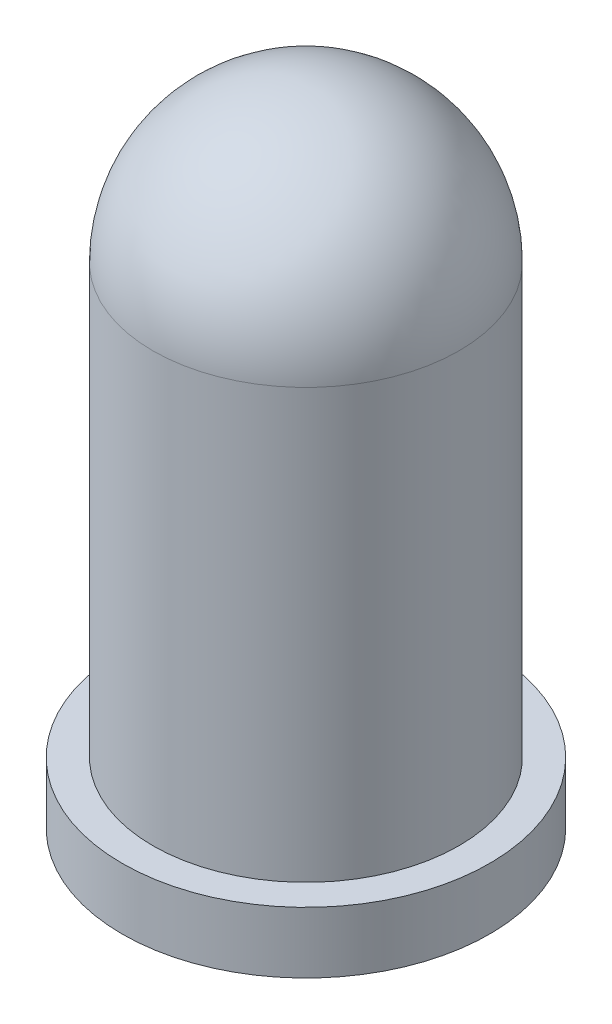
ISO-10303-21;
HEADER;
FILE_DESCRIPTION(('STEP AP214'),'2;1');
FILE_NAME('part.step','',(''),(''),'','','');
FILE_SCHEMA(('AUTOMOTIVE_DESIGN { 1 0 10303 214 1 1 1 1 }'));
ENDSEC;
DATA;
#1=APPLICATION_CONTEXT('core data for automotive mechanical design processes');
#2=APPLICATION_PROTOCOL_DEFINITION('international standard','automotive_design',2000,#1);
#3=PRODUCT_CONTEXT('',#1,'mechanical');
#4=PRODUCT('Part','Part','',(#3));
#5=PRODUCT_RELATED_PRODUCT_CATEGORY('part','',(#4));
#6=PRODUCT_DEFINITION_FORMATION('','',#4);
#7=PRODUCT_DEFINITION_CONTEXT('part definition',#1,'design');
#8=PRODUCT_DEFINITION('design','',#6,#7);
#9=PRODUCT_DEFINITION_SHAPE('','',#8);
#10=(LENGTH_UNIT() NAMED_UNIT(*) SI_UNIT(.MILLI.,.METRE.));
#11=(NAMED_UNIT(*) PLANE_ANGLE_UNIT() SI_UNIT($,.RADIAN.));
#12=(NAMED_UNIT(*) SI_UNIT($,.STERADIAN.) SOLID_ANGLE_UNIT());
#13=UNCERTAINTY_MEASURE_WITH_UNIT(LENGTH_MEASURE(1.E-05),#10,'distance_accuracy_value','');
#14=(GEOMETRIC_REPRESENTATION_CONTEXT(3) GLOBAL_UNCERTAINTY_ASSIGNED_CONTEXT((#13)) GLOBAL_UNIT_ASSIGNED_CONTEXT((#10,
#11,#12)) REPRESENTATION_CONTEXT('',''));
#15=CARTESIAN_POINT('',(0.,0.,0.));
#16=DIRECTION('',(0.,0.,1.));
#17=DIRECTION('',(1.,0.,0.));
#18=AXIS2_PLACEMENT_3D('',#15,#16,#17);
#19=CARTESIAN_POINT('',(0.,8.,0.));
#20=DIRECTION('',(0.,1.,0.));
#21=DIRECTION('',(1.,0.,0.));
#22=AXIS2_PLACEMENT_3D('',#19,#20,#21);
#23=SPHERICAL_SURFACE('',#22,2.5);
#24=CARTESIAN_POINT('',(0.,8.,0.));
#25=DIRECTION('',(0.,1.,0.));
#26=DIRECTION('',(0.,0.,1.));
#27=AXIS2_PLACEMENT_3D('',#24,#25,#26);
#28=CIRCLE('',#27,2.5);
#29=CARTESIAN_POINT('',(0.,8.,2.5));
#30=VERTEX_POINT('',#29);
#31=EDGE_CURVE('E10',#30,#30,#28,.T.);
#32=ORIENTED_EDGE('',*,*,#31,.T.);
#33=EDGE_LOOP('',(#32));
#34=FACE_BOUND('',#33,.T.);
#35=ADVANCED_FACE('F33',(#34),#23,.T.);
#36=CARTESIAN_POINT('',(0.,12.90625,0.));
#37=DIRECTION('',(0.,1.,0.));
#38=DIRECTION('',(0.,0.,1.));
#39=AXIS2_PLACEMENT_3D('',#36,#37,#38);
#40=CYLINDRICAL_SURFACE('',#39,2.5);
#41=ORIENTED_EDGE('',*,*,#31,.F.);
#42=EDGE_LOOP('',(#41));
#43=FACE_BOUND('',#42,.T.);
#44=CARTESIAN_POINT('',(0.,1.,0.));
#45=DIRECTION('',(0.,1.,0.));
#46=DIRECTION('',(0.,0.,1.));
#47=AXIS2_PLACEMENT_3D('',#44,#45,#46);
#48=CIRCLE('',#47,2.5);
#49=CARTESIAN_POINT('',(0.,1.,2.5));
#50=VERTEX_POINT('',#49);
#51=EDGE_CURVE('E39',#50,#50,#48,.T.);
#52=ORIENTED_EDGE('',*,*,#51,.T.);
#53=EDGE_LOOP('',(#52));
#54=FACE_BOUND('',#53,.T.);
#55=ADVANCED_FACE('F65',(#43,#54),#40,.T.);
#56=CARTESIAN_POINT('',(0.,1.,0.));
#57=DIRECTION('',(0.,-1.,0.));
#58=DIRECTION('',(0.,0.,-1.));
#59=AXIS2_PLACEMENT_3D('',#56,#57,#58);
#60=PLANE('',#59);
#61=ORIENTED_EDGE('',*,*,#51,.F.);
#62=EDGE_LOOP('',(#61));
#63=FACE_BOUND('',#62,.T.);
#64=CARTESIAN_POINT('',(0.,0.999999999999999,0.));
#65=DIRECTION('',(0.,1.,0.));
#66=DIRECTION('',(0.,0.,1.));
#67=AXIS2_PLACEMENT_3D('',#64,#65,#66);
#68=CIRCLE('',#67,3.);
#69=CARTESIAN_POINT('',(0.,0.999999999999999,3.));
#70=VERTEX_POINT('',#69);
#71=EDGE_CURVE('E43',#70,#70,#68,.T.);
#72=ORIENTED_EDGE('',*,*,#71,.T.);
#73=EDGE_LOOP('',(#72));
#74=FACE_BOUND('',#73,.T.);
#75=ADVANCED_FACE('F62',(#63,#74),#60,.F.);
#76=CARTESIAN_POINT('',(0.,12.90625,0.));
#77=DIRECTION('',(0.,1.,0.));
#78=DIRECTION('',(0.,0.,1.));
#79=AXIS2_PLACEMENT_3D('',#76,#77,#78);
#80=CYLINDRICAL_SURFACE('',#79,3.);
#81=CARTESIAN_POINT('',(0.,0.,0.));
#82=DIRECTION('',(0.,1.,0.));
#83=DIRECTION('',(0.,0.,1.));
#84=AXIS2_PLACEMENT_3D('',#81,#82,#83);
#85=CIRCLE('',#84,3.);
#86=CARTESIAN_POINT('',(0.,0.,3.));
#87=VERTEX_POINT('',#86);
#88=EDGE_CURVE('E47',#87,#87,#85,.T.);
#89=ORIENTED_EDGE('',*,*,#88,.T.);
#90=EDGE_LOOP('',(#89));
#91=FACE_BOUND('',#90,.T.);
#92=ORIENTED_EDGE('',*,*,#71,.F.);
#93=EDGE_LOOP('',(#92));
#94=FACE_BOUND('',#93,.T.);
#95=ADVANCED_FACE('F53',(#91,#94),#80,.T.);
#96=CARTESIAN_POINT('',(0.,0.,0.));
#97=DIRECTION('',(0.,-1.,0.));
#98=DIRECTION('',(0.,0.,-1.));
#99=AXIS2_PLACEMENT_3D('',#96,#97,#98);
#100=PLANE('',#99);
#101=ORIENTED_EDGE('',*,*,#88,.F.);
#102=EDGE_LOOP('',(#101));
#103=FACE_BOUND('',#102,.T.);
#104=ADVANCED_FACE('F56',(#103),#100,.T.);
#105=CLOSED_SHELL('',(#35,#55,#75,#95,#104));
#106=MANIFOLD_SOLID_BREP('B2',#105);
#107=ADVANCED_BREP_SHAPE_REPRESENTATION('',(#18,#106),#14);
#108=SHAPE_DEFINITION_REPRESENTATION(#9,#107);
ENDSEC;
END-ISO-10303-21;
